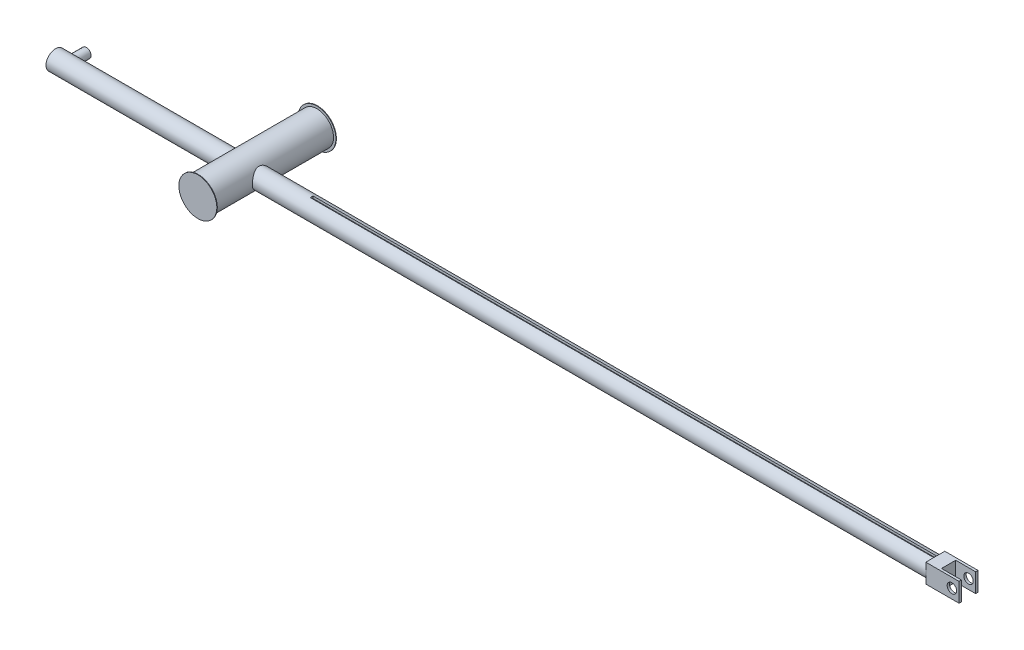
ISO-10303-21;
HEADER;
FILE_DESCRIPTION(('STEP AP214'),'2;1');
FILE_NAME('part.step','',(''),(''),'','','');
FILE_SCHEMA(('AUTOMOTIVE_DESIGN { 1 0 10303 214 1 1 1 1 }'));
ENDSEC;
DATA;
#1=APPLICATION_CONTEXT('core data for automotive mechanical design processes');
#2=APPLICATION_PROTOCOL_DEFINITION('international standard','automotive_design',2000,#1);
#3=PRODUCT_CONTEXT('',#1,'mechanical');
#4=PRODUCT('Part','Part','',(#3));
#5=PRODUCT_RELATED_PRODUCT_CATEGORY('part','',(#4));
#6=PRODUCT_DEFINITION_FORMATION('','',#4);
#7=PRODUCT_DEFINITION_CONTEXT('part definition',#1,'design');
#8=PRODUCT_DEFINITION('design','',#6,#7);
#9=PRODUCT_DEFINITION_SHAPE('','',#8);
#10=(LENGTH_UNIT() NAMED_UNIT(*) SI_UNIT(.MILLI.,.METRE.));
#11=(NAMED_UNIT(*) PLANE_ANGLE_UNIT() SI_UNIT($,.RADIAN.));
#12=(NAMED_UNIT(*) SI_UNIT($,.STERADIAN.) SOLID_ANGLE_UNIT());
#13=UNCERTAINTY_MEASURE_WITH_UNIT(LENGTH_MEASURE(1.E-05),#10,'distance_accuracy_value','');
#14=(GEOMETRIC_REPRESENTATION_CONTEXT(3) GLOBAL_UNCERTAINTY_ASSIGNED_CONTEXT((#13)) GLOBAL_UNIT_ASSIGNED_CONTEXT((#10,
#11,#12)) REPRESENTATION_CONTEXT('',''));
#15=CARTESIAN_POINT('',(0.,0.,0.));
#16=DIRECTION('',(0.,0.,1.));
#17=DIRECTION('',(1.,0.,0.));
#18=AXIS2_PLACEMENT_3D('',#15,#16,#17);
#19=CARTESIAN_POINT('',(192.4,0.,0.));
#20=DIRECTION('',(1.,0.,0.));
#21=DIRECTION('',(0.,0.,-1.));
#22=AXIS2_PLACEMENT_3D('',#19,#20,#21);
#23=PLANE('',#22);
#24=DIRECTION('',(0.,1.,0.));
#25=VECTOR('',#24,1.);
#26=CARTESIAN_POINT('',(192.4,-2.,1.5));
#27=LINE('',#26,#25);
#28=CARTESIAN_POINT('',(192.4,-2.,1.5));
#29=VERTEX_POINT('',#28);
#30=CARTESIAN_POINT('',(192.4,2.,1.5));
#31=VERTEX_POINT('',#30);
#32=EDGE_CURVE('E192',#29,#31,#27,.T.);
#33=ORIENTED_EDGE('',*,*,#32,.T.);
#34=DIRECTION('',(0.,0.,-1.));
#35=VECTOR('',#34,1.);
#36=CARTESIAN_POINT('',(192.4,2.,-2.));
#37=LINE('',#36,#35);
#38=CARTESIAN_POINT('',(192.4,2.,2.));
#39=VERTEX_POINT('',#38);
#40=EDGE_CURVE('E201',#39,#31,#37,.T.);
#41=ORIENTED_EDGE('',*,*,#40,.F.);
#42=DIRECTION('',(0.,-1.,0.));
#43=VECTOR('',#42,1.);
#44=CARTESIAN_POINT('',(192.4,2.,2.));
#45=LINE('',#44,#43);
#46=CARTESIAN_POINT('',(192.4,-2.,2.));
#47=VERTEX_POINT('',#46);
#48=EDGE_CURVE('E212',#39,#47,#45,.T.);
#49=ORIENTED_EDGE('',*,*,#48,.T.);
#50=DIRECTION('',(0.,0.,-1.));
#51=VECTOR('',#50,1.);
#52=CARTESIAN_POINT('',(192.4,-2.,-2.));
#53=LINE('',#52,#51);
#54=EDGE_CURVE('E213',#47,#29,#53,.T.);
#55=ORIENTED_EDGE('',*,*,#54,.T.);
#56=EDGE_LOOP('',(#33,#41,#49,#55));
#57=FACE_BOUND('',#56,.T.);
#58=ADVANCED_FACE('F34',(#57),#23,.T.);
#59=CARTESIAN_POINT('',(192.4,0.,0.));
#60=DIRECTION('',(-1.,0.,0.));
#61=DIRECTION('',(0.,0.,1.));
#62=AXIS2_PLACEMENT_3D('',#59,#60,#61);
#63=CYLINDRICAL_SURFACE('',#62,2.);
#64=CARTESIAN_POINT('',(43.5,0.,2.));
#65=CARTESIAN_POINT('',(43.4999955349717,-0.103121073276092,1.99999502725213));
#66=CARTESIAN_POINT('',(43.4953921880425,-0.206418292241567,1.99196945368553));
#67=CARTESIAN_POINT('',(43.4774196479239,-0.409938220573771,1.96025838229543));
#68=CARTESIAN_POINT('',(43.4640278599276,-0.510152306170781,1.93653251819956));
#69=CARTESIAN_POINT('',(43.4298464088303,-0.704136692781984,1.87470120206554));
#70=CARTESIAN_POINT('',(43.4090919539548,-0.797935169936742,1.83666413455008));
#71=CARTESIAN_POINT('',(43.361993300559,-0.977566018148799,1.74769013430304));
#72=CARTESIAN_POINT('',(43.335650659868,-1.06340059975111,1.69675679592545));
#73=CARTESIAN_POINT('',(43.2774142865461,-1.23168334606475,1.57931420254713));
#74=CARTESIAN_POINT('',(43.2452570113694,-1.31343890348908,1.51194552690007));
#75=CARTESIAN_POINT('',(43.1796447604236,-1.46516457042852,1.36544265813629));
#76=CARTESIAN_POINT('',(43.1461882973923,-1.53512065191322,1.28629466837635));
#77=CARTESIAN_POINT('',(43.0774783873558,-1.66894420512511,1.10830358077027));
#78=CARTESIAN_POINT('',(43.0424247888563,-1.73132377325173,1.00825487214971));
#79=CARTESIAN_POINT('',(42.9791301999857,-1.83811251873573,0.797049727904503));
#80=CARTESIAN_POINT('',(42.9508789226201,-1.88254890095161,0.685910428990706));
#81=CARTESIAN_POINT('',(42.9109223878371,-1.94359344806483,0.480854835647837));
#82=CARTESIAN_POINT('',(42.8969392560299,-1.96418339921187,0.3885684858251));
#83=CARTESIAN_POINT('',(42.8778133907658,-1.99210676207498,0.201150264306681));
#84=CARTESIAN_POINT('',(42.8726611811328,-1.99945438414142,0.10602155436303));
#85=CARTESIAN_POINT('',(42.871941872767,-2.00048758468052,-0.0844746853087221));
#86=CARTESIAN_POINT('',(42.876387864143,-1.99415450528781,-0.179842363786519));
#87=CARTESIAN_POINT('',(42.8942294693773,-1.96816496378147,-0.36790250518673));
#88=CARTESIAN_POINT('',(42.9076312408492,-1.94849933463808,-0.460593081672926));
#89=CARTESIAN_POINT('',(42.9415370135358,-1.8969175277205,-0.640664930319432));
#90=CARTESIAN_POINT('',(42.9620133688412,-1.86504898450024,-0.728065335499013));
#91=CARTESIAN_POINT('',(43.0078588664962,-1.79016995537344,-0.896549852677721));
#92=CARTESIAN_POINT('',(43.0332298799024,-1.74715520649774,-0.977631532555188));
#93=CARTESIAN_POINT('',(43.0909281371212,-1.64323768381765,-1.14497289536971));
#94=CARTESIAN_POINT('',(43.1237185860108,-1.5805729697491,-1.22998014172813));
#95=CARTESIAN_POINT('',(43.1897193567918,-1.44275323922578,-1.38908431950143));
#96=CARTESIAN_POINT('',(43.2229300141009,-1.36758757586109,-1.46317184839195));
#97=CARTESIAN_POINT('',(43.2905044560227,-1.19664071603843,-1.60682420141337));
#98=CARTESIAN_POINT('',(43.3245687973403,-1.09948658535069,-1.67491295111797));
#99=CARTESIAN_POINT('',(43.3858660255659,-0.893015490655637,-1.79350679145514));
#100=CARTESIAN_POINT('',(43.4131032147514,-0.783706249477125,-1.84402296365141));
#101=CARTESIAN_POINT('',(43.4559803209716,-0.563793778179159,-1.92218392422592));
#102=CARTESIAN_POINT('',(43.4722917003182,-0.453802193453638,-1.95116821061519));
#103=CARTESIAN_POINT('',(43.4942790249968,-0.229493069556969,-1.99003815887878));
#104=CARTESIAN_POINT('',(43.4999654585023,-0.115179910205488,-1.9999426552334));
#105=CARTESIAN_POINT('',(43.5000301358277,0.0995234593134482,-2.00005001113385));
#106=CARTESIAN_POINT('',(43.4956961183647,0.199920938989515,-1.99249646618427));
#107=CARTESIAN_POINT('',(43.4787417458306,0.397754958971081,-1.96259942660487));
#108=CARTESIAN_POINT('',(43.466121248704,0.495191448486274,-1.94025567842609));
#109=CARTESIAN_POINT('',(43.4339164488775,0.683570804723372,-1.88211536153292));
#110=CARTESIAN_POINT('',(43.4144048814158,0.774570013012135,-1.84645909005904));
#111=CARTESIAN_POINT('',(43.3699949687788,0.949355356164677,-1.76298426395288));
#112=CARTESIAN_POINT('',(43.345095326844,1.03313974782512,-1.71516278100544));
#113=CARTESIAN_POINT('',(43.2889746799162,1.20050997117731,-1.60310615914214));
#114=CARTESIAN_POINT('',(43.2573654662018,1.2831673708561,-1.53768066183731));
#115=CARTESIAN_POINT('',(43.1925059083551,1.43697220197862,-1.39503833887721));
#116=CARTESIAN_POINT('',(43.1592537164003,1.50810627029583,-1.31780802245906));
#117=CARTESIAN_POINT('',(43.0904217356236,1.6449272799719,-1.14359747619125));
#118=CARTESIAN_POINT('',(43.0549959728418,1.70912186715333,-1.04537520140782));
#119=CARTESIAN_POINT('',(42.9903134742197,1.81993376296719,-0.837645368584634));
#120=CARTESIAN_POINT('',(42.9610485628928,1.86657443137411,-0.728153057102555));
#121=CARTESIAN_POINT('',(42.918512334296,1.93222109228878,-0.524764735991317));
#122=CARTESIAN_POINT('',(42.9031610555495,1.95499953445202,-0.432523508968233));
#123=CARTESIAN_POINT('',(42.8811903233133,1.98724336712396,-0.244765907656752));
#124=CARTESIAN_POINT('',(42.8745609347664,1.99672390601701,-0.149253387204244));
#125=CARTESIAN_POINT('',(42.8709931203382,2.00185191685029,0.0425227698669184));
#126=CARTESIAN_POINT('',(42.8740742052857,1.99747153858607,0.138787530545769));
#127=CARTESIAN_POINT('',(42.8895014010665,1.97508383758896,0.328977150692359));
#128=CARTESIAN_POINT('',(42.9018533718013,1.95706789608754,0.422900491394058));
#129=CARTESIAN_POINT('',(42.9338380773917,1.90877044170586,0.604375633033566));
#130=CARTESIAN_POINT('',(42.9533411410288,1.87870654392501,0.692009558249193));
#131=CARTESIAN_POINT('',(42.997495532853,1.8074218972167,0.861199095743598));
#132=CARTESIAN_POINT('',(43.0221487587385,1.7661970341072,0.942752452421584));
#133=CARTESIAN_POINT('',(43.0784352308926,1.66643167949608,1.11084333294312));
#134=CARTESIAN_POINT('',(43.1105587329587,1.60620233461965,1.19621458045878));
#135=CARTESIAN_POINT('',(43.1756273473033,1.4733860443388,1.35645763372196));
#136=CARTESIAN_POINT('',(43.2085731510201,1.40078837818172,1.4313202271041));
#137=CARTESIAN_POINT('',(43.2764181020108,1.23454792336605,1.57786072312093));
#138=CARTESIAN_POINT('',(43.3110499554466,1.13941038595579,1.64798238220286));
#139=CARTESIAN_POINT('',(43.3739962322054,0.93668149876142,1.77105878863119));
#140=CARTESIAN_POINT('',(43.4023141898287,0.829097167751335,1.82402314759853));
#141=CARTESIAN_POINT('',(43.4451526868773,0.62438250119413,1.90261714413288));
#142=CARTESIAN_POINT('',(43.461231112711,0.528793868969366,1.93143235098223));
#143=CARTESIAN_POINT('',(43.4854461242423,0.33357246552143,1.97450218307986));
#144=CARTESIAN_POINT('',(43.4936056490278,0.233952251382016,1.98879887048321));
#145=CARTESIAN_POINT('',(43.4982936366316,0.111553482810445,1.99701217642184));
#146=CARTESIAN_POINT('',(43.4989325771349,0.0892655426398858,1.99813153012492));
#147=CARTESIAN_POINT('',(43.4997862645308,0.0446544907867955,1.99962601938614));
#148=CARTESIAN_POINT('',(43.5000009669239,0.02233137566042,2.00000107687301));
#149=CARTESIAN_POINT('',(43.5,0.,2.));
#150=B_SPLINE_CURVE_WITH_KNOTS('',3,(#64,#65,#66,#67,#68,#69,#70,#71,#72,#73,#74,#75,#76,#77,
#78,#79,#80,#81,#82,#83,#84,#85,#86,#87,#88,#89,#90,#91,#92,#93,#94,#95,#96,#97,#98,#99,#100,
#101,#102,#103,#104,#105,#106,#107,#108,#109,#110,#111,#112,#113,#114,#115,#116,#117,#118,#119,
#120,#121,#122,#123,#124,#125,#126,#127,#128,#129,#130,#131,#132,#133,#134,#135,#136,#137,#138,
#139,#140,#141,#142,#143,#144,#145,#146,#147,#148,#149),.UNSPECIFIED.,.T.,.F.,(4,2,2,2,2,2,2,2,
2,2,2,2,2,2,2,2,2,2,2,2,2,2,2,2,2,2,2,2,2,2,2,2,2,2,2,2,2,2,2,2,2,2,4),(0.,0.309268603260582,
0.619335457908354,0.927939130491693,1.23645688582087,1.56726264134174,1.89845895106406,
2.26564840439507,2.63227902790324,2.91779157032783,3.20299754625059,3.48859273422685,
3.77438448762791,4.05907183070886,4.343868216209,4.67430361887066,5.00502190433098,
5.37340568410989,5.7415567319231,6.08426181113764,6.4266284177419,6.72747548140297,
7.028327702629,7.32609492686909,7.62393389525625,7.95277463151786,8.28199402221957,
8.64793130772768,9.01337988790351,9.30087929443283,9.58805092761003,9.87579992974731,
10.1637309643623,10.4466801504154,10.7297337802306,11.0563737137124,11.3832982298873,
11.7509152703937,12.1183260120783,12.4204193511693,12.7216349655948,12.7886015789519,
12.85557521625),.UNSPECIFIED.);
#151=CARTESIAN_POINT('',(43.5,0.,2.));
#152=VERTEX_POINT('',#151);
#153=EDGE_CURVE('E258',#152,#152,#150,.T.);
#154=ORIENTED_EDGE('',*,*,#153,.T.);
#155=EDGE_LOOP('',(#154));
#156=FACE_BOUND('',#155,.T.);
#157=DIRECTION('',(-1.,0.,0.));
#158=VECTOR('',#157,1.);
#159=CARTESIAN_POINT('',(192.4,1.97737199332852,0.3));
#160=LINE('',#159,#158);
#161=CARTESIAN_POINT('',(185.4,1.97737199332852,0.3));
#162=VERTEX_POINT('',#161);
#163=CARTESIAN_POINT('',(54.,1.97737199332852,0.3));
#164=VERTEX_POINT('',#163);
#165=EDGE_CURVE('E158',#162,#164,#160,.T.);
#166=ORIENTED_EDGE('',*,*,#165,.T.);
#167=CARTESIAN_POINT('',(54.,0.,0.));
#168=DIRECTION('',(-1.,0.,0.));
#169=DIRECTION('',(0.,0.,1.));
#170=AXIS2_PLACEMENT_3D('',#167,#168,#169);
#171=CIRCLE('',#170,2.);
#172=CARTESIAN_POINT('',(54.,1.97737199332851,-0.300000000000001));
#173=VERTEX_POINT('',#172);
#174=EDGE_CURVE('E11',#164,#173,#171,.T.);
#175=ORIENTED_EDGE('',*,*,#174,.T.);
#176=DIRECTION('',(-1.,0.,0.));
#177=VECTOR('',#176,1.);
#178=CARTESIAN_POINT('',(192.4,1.97737199332851,-0.300000000000035));
#179=LINE('',#178,#177);
#180=CARTESIAN_POINT('',(185.4,1.97737199332851,-0.300000000000034));
#181=VERTEX_POINT('',#180);
#182=EDGE_CURVE('E163',#173,#181,#179,.F.);
#183=ORIENTED_EDGE('',*,*,#182,.T.);
#184=CARTESIAN_POINT('',(185.4,0.,0.));
#185=DIRECTION('',(1.,0.,0.));
#186=DIRECTION('',(0.,0.,-1.));
#187=AXIS2_PLACEMENT_3D('',#184,#185,#186);
#188=CIRCLE('',#187,2.);
#189=CARTESIAN_POINT('',(185.4,0.,-2.));
#190=VERTEX_POINT('',#189);
#191=EDGE_CURVE('E340',#190,#181,#188,.T.);
#192=ORIENTED_EDGE('',*,*,#191,.F.);
#193=CARTESIAN_POINT('',(185.4,-2.,0.));
#194=VERTEX_POINT('',#193);
#195=EDGE_CURVE('E262',#194,#190,#188,.T.);
#196=ORIENTED_EDGE('',*,*,#195,.F.);
#197=CARTESIAN_POINT('',(185.4,0.,2.));
#198=VERTEX_POINT('',#197);
#199=EDGE_CURVE('E347',#198,#194,#188,.T.);
#200=ORIENTED_EDGE('',*,*,#199,.F.);
#201=EDGE_CURVE('E43',#162,#198,#188,.T.);
#202=ORIENTED_EDGE('',*,*,#201,.F.);
#203=EDGE_LOOP('',(#166,#175,#183,#192,#196,#200,#202));
#204=FACE_BOUND('',#203,.T.);
#205=ADVANCED_FACE('F295',(#156,#204),#63,.T.);
#206=CARTESIAN_POINT('',(40.,0.,-15.1));
#207=DIRECTION('',(0.,0.,1.));
#208=DIRECTION('',(1.,0.,0.));
#209=AXIS2_PLACEMENT_3D('',#206,#207,#208);
#210=CYLINDRICAL_SURFACE('',#209,3.5);
#211=ORIENTED_EDGE('',*,*,#153,.F.);
#212=EDGE_LOOP('',(#211));
#213=FACE_BOUND('',#212,.T.);
#214=CARTESIAN_POINT('',(36.5,0.,2.));
#215=CARTESIAN_POINT('',(36.5000044650284,0.103121073276098,1.99999502725213));
#216=CARTESIAN_POINT('',(36.5046078119575,0.206418292241578,1.99196945368553));
#217=CARTESIAN_POINT('',(36.522580352076,0.409938220573787,1.96025838229543));
#218=CARTESIAN_POINT('',(36.5359721400724,0.510152306170795,1.93653251819956));
#219=CARTESIAN_POINT('',(36.5701535911697,0.704136692781999,1.87470120206554));
#220=CARTESIAN_POINT('',(36.5909080460452,0.797935169936758,1.83666413455008));
#221=CARTESIAN_POINT('',(36.638006699441,0.977566018148819,1.74769013430303));
#222=CARTESIAN_POINT('',(36.664349340132,1.06340059975114,1.69675679592544));
#223=CARTESIAN_POINT('',(36.7225857134539,1.23168334606478,1.57931420254711));
#224=CARTESIAN_POINT('',(36.7547429886306,1.31343890348911,1.51194552690005));
#225=CARTESIAN_POINT('',(36.8203552395764,1.46516457042855,1.36544265813626));
#226=CARTESIAN_POINT('',(36.8538117026077,1.53512065191324,1.28629466837632));
#227=CARTESIAN_POINT('',(36.9225216126442,1.66894420512513,1.10830358077024));
#228=CARTESIAN_POINT('',(36.9575752111437,1.73132377325175,1.00825487214967));
#229=CARTESIAN_POINT('',(37.0208698000143,1.83811251873575,0.797049727904456));
#230=CARTESIAN_POINT('',(37.0491210773799,1.88254890095163,0.685910428990657));
#231=CARTESIAN_POINT('',(37.0890776121629,1.94359344806484,0.480854835647787));
#232=CARTESIAN_POINT('',(37.1030607439701,1.96418339921188,0.388568485825054));
#233=CARTESIAN_POINT('',(37.1221866092342,1.99210676207498,0.201150264306641));
#234=CARTESIAN_POINT('',(37.1273388188672,1.99945438414142,0.106021554362994));
#235=CARTESIAN_POINT('',(37.128058127233,2.00048758468052,-0.0844746853087508));
#236=CARTESIAN_POINT('',(37.123612135857,1.99415450528781,-0.179842363786543));
#237=CARTESIAN_POINT('',(37.1057705306227,1.96816496378146,-0.367902505186745));
#238=CARTESIAN_POINT('',(37.0923687591508,1.94849933463808,-0.460593081672937));
#239=CARTESIAN_POINT('',(37.0584629864642,1.8969175277205,-0.640664930319436));
#240=CARTESIAN_POINT('',(37.0379866311588,1.86504898450024,-0.728065335499013));
#241=CARTESIAN_POINT('',(36.9921411335038,1.79016995537345,-0.896549852677715));
#242=CARTESIAN_POINT('',(36.9667701200976,1.74715520649775,-0.97763153255518));
#243=CARTESIAN_POINT('',(36.9090718628788,1.64323768381766,-1.1449728953697));
#244=CARTESIAN_POINT('',(36.8762814139892,1.58057296974911,-1.22998014172812));
#245=CARTESIAN_POINT('',(36.8102806432082,1.44275323922579,-1.38908431950141));
#246=CARTESIAN_POINT('',(36.7770699858991,1.36758757586111,-1.46317184839193));
#247=CARTESIAN_POINT('',(36.7094955439773,1.19664071603845,-1.60682420141335));
#248=CARTESIAN_POINT('',(36.6754312026597,1.09948658535071,-1.67491295111796));
#249=CARTESIAN_POINT('',(36.6141339744341,0.893015490655655,-1.79350679145513));
#250=CARTESIAN_POINT('',(36.5868967852486,0.783706249477144,-1.8440229636514));
#251=CARTESIAN_POINT('',(36.5440196790284,0.563793778179177,-1.92218392422592));
#252=CARTESIAN_POINT('',(36.5277082996818,0.453802193453655,-1.95116821061519));
#253=CARTESIAN_POINT('',(36.5057209750032,0.229493069556984,-1.99003815887878));
#254=CARTESIAN_POINT('',(36.5000345414977,0.1151799102055,-1.9999426552334));
#255=CARTESIAN_POINT('',(36.4999698641723,-0.0995234593134409,-2.00005001113385));
#256=CARTESIAN_POINT('',(36.5043038816353,-0.199920938989511,-1.99249646618427));
#257=CARTESIAN_POINT('',(36.5212582541694,-0.397754958971082,-1.96259942660487));
#258=CARTESIAN_POINT('',(36.533878751296,-0.495191448486278,-1.94025567842609));
#259=CARTESIAN_POINT('',(36.5660835511226,-0.683570804723379,-1.88211536153292));
#260=CARTESIAN_POINT('',(36.5855951185842,-0.774570013012145,-1.84645909005903));
#261=CARTESIAN_POINT('',(36.6300050312212,-0.94935535616469,-1.76298426395287));
#262=CARTESIAN_POINT('',(36.654904673156,-1.03313974782513,-1.71516278100543));
#263=CARTESIAN_POINT('',(36.7110253200838,-1.20050997117733,-1.60310615914212));
#264=CARTESIAN_POINT('',(36.7426345337982,-1.28316737085612,-1.5376806618373));
#265=CARTESIAN_POINT('',(36.8074940916449,-1.43697220197864,-1.39503833887719));
#266=CARTESIAN_POINT('',(36.8407462835997,-1.50810627029585,-1.31780802245903));
#267=CARTESIAN_POINT('',(36.9095782643764,-1.64492727997192,-1.14359747619122));
#268=CARTESIAN_POINT('',(36.9450040271582,-1.70912186715335,-1.04537520140779));
#269=CARTESIAN_POINT('',(37.0096865257803,-1.81993376296721,-0.837645368584599));
#270=CARTESIAN_POINT('',(37.0389514371072,-1.86657443137412,-0.728153057102519));
#271=CARTESIAN_POINT('',(37.081487665704,-1.93222109228879,-0.52476473599128));
#272=CARTESIAN_POINT('',(37.0968389444505,-1.95499953445203,-0.432523508968198));
#273=CARTESIAN_POINT('',(37.1188096766867,-1.98724336712396,-0.244765907656723));
#274=CARTESIAN_POINT('',(37.1254390652336,-1.99672390601701,-0.14925338720422));
#275=CARTESIAN_POINT('',(37.1290068796618,-2.00185191685028,0.0425227698669336));
#276=CARTESIAN_POINT('',(37.1259257947143,-1.99747153858607,0.13878753054578));
#277=CARTESIAN_POINT('',(37.1104985989335,-1.97508383758896,0.328977150692361));
#278=CARTESIAN_POINT('',(37.0981466281987,-1.95706789608754,0.422900491394057));
#279=CARTESIAN_POINT('',(37.0661619226083,-1.90877044170586,0.604375633033557));
#280=CARTESIAN_POINT('',(37.0466588589712,-1.87870654392502,0.69200955824918));
#281=CARTESIAN_POINT('',(37.002504467147,-1.80742189721671,0.861199095743579));
#282=CARTESIAN_POINT('',(36.9778512412615,-1.76619703410721,0.942752452421563));
#283=CARTESIAN_POINT('',(36.9215647691074,-1.66643167949609,1.1108433329431));
#284=CARTESIAN_POINT('',(36.8894412670413,-1.60620233461967,1.19621458045875));
#285=CARTESIAN_POINT('',(36.8243726526967,-1.47338604433883,1.35645763372193));
#286=CARTESIAN_POINT('',(36.7914268489799,-1.40078837818175,1.43132022710407));
#287=CARTESIAN_POINT('',(36.7235818979893,-1.23454792336608,1.5778607231209));
#288=CARTESIAN_POINT('',(36.6889500445534,-1.13941038595583,1.64798238220283));
#289=CARTESIAN_POINT('',(36.6260037677946,-0.936681498761457,1.77105878863117));
#290=CARTESIAN_POINT('',(36.5976858101713,-0.829097167751373,1.82402314759851));
#291=CARTESIAN_POINT('',(36.5548473131227,-0.624382501194166,1.90261714413287));
#292=CARTESIAN_POINT('',(36.538768887289,-0.5287938689694,1.93143235098222));
#293=CARTESIAN_POINT('',(36.5145538757578,-0.33357246552146,1.97450218307986));
#294=CARTESIAN_POINT('',(36.5063943509723,-0.233952251382045,1.9887988704832));
#295=CARTESIAN_POINT('',(36.5017063633684,-0.111553482810469,1.99701217642184));
#296=CARTESIAN_POINT('',(36.5010674228651,-0.0892655426399053,1.99813153012492));
#297=CARTESIAN_POINT('',(36.5002137354692,-0.0446544907868056,1.99962601938614));
#298=CARTESIAN_POINT('',(36.4999990330762,-0.0223313756604251,2.00000107687301));
#299=CARTESIAN_POINT('',(36.5,0.,2.));
#300=B_SPLINE_CURVE_WITH_KNOTS('',3,(#214,#215,#216,#217,#218,#219,#220,#221,#222,#223,#224,
#225,#226,#227,#228,#229,#230,#231,#232,#233,#234,#235,#236,#237,#238,#239,#240,#241,#242,#243,
#244,#245,#246,#247,#248,#249,#250,#251,#252,#253,#254,#255,#256,#257,#258,#259,#260,#261,#262,
#263,#264,#265,#266,#267,#268,#269,#270,#271,#272,#273,#274,#275,#276,#277,#278,#279,#280,#281,
#282,#283,#284,#285,#286,#287,#288,#289,#290,#291,#292,#293,#294,#295,#296,#297,#298,#299),
.UNSPECIFIED.,.T.,.F.,(4,2,2,2,2,2,2,2,2,2,2,2,2,2,2,2,2,2,2,2,2,2,2,2,2,2,2,2,2,2,2,2,2,2,2,2,
2,2,2,2,2,2,4),(0.,0.309268603260594,0.619335457908367,0.927939130491709,1.2364568858209,
1.56726264134178,1.8984589510641,2.26564840439512,2.63227902790329,2.91779157032787,
3.20299754625062,3.48859273422687,3.77438448762791,4.05907183070885,4.34386821620898,
4.67430361887064,5.00502190433095,5.37340568410986,5.74155673192308,6.08426181113762,
6.42662841774189,6.72747548140296,7.028327702629,7.3260949268691,7.62393389525627,
7.95277463151788,8.2819940222196,8.64793130772771,9.01337988790355,9.30087929443286,
9.58805092761005,9.87579992974731,10.1637309643622,10.4466801504154,10.7297337802306,
11.0563737137124,11.3832982298872,11.7509152703936,12.1183260120782,12.4204193511693,
12.7216349655948,12.7886015789519,12.85557521625),.UNSPECIFIED.);
#301=CARTESIAN_POINT('',(36.5,0.,2.));
#302=VERTEX_POINT('',#301);
#303=EDGE_CURVE('E269',#302,#302,#300,.T.);
#304=ORIENTED_EDGE('',*,*,#303,.F.);
#305=EDGE_LOOP('',(#304));
#306=FACE_BOUND('',#305,.T.);
#307=CARTESIAN_POINT('',(40.,0.,-15.1));
#308=DIRECTION('',(0.,0.,1.));
#309=DIRECTION('',(1.,0.,0.));
#310=AXIS2_PLACEMENT_3D('',#307,#308,#309);
#311=CIRCLE('',#310,3.5);
#312=CARTESIAN_POINT('',(43.5,0.,-15.1));
#313=VERTEX_POINT('',#312);
#314=EDGE_CURVE('E242',#313,#313,#311,.T.);
#315=ORIENTED_EDGE('',*,*,#314,.T.);
#316=EDGE_LOOP('',(#315));
#317=FACE_BOUND('',#316,.T.);
#318=CARTESIAN_POINT('',(40.,0.,9.9));
#319=DIRECTION('',(0.,0.,1.));
#320=DIRECTION('',(1.,0.,0.));
#321=AXIS2_PLACEMENT_3D('',#318,#319,#320);
#322=CIRCLE('',#321,3.5);
#323=CARTESIAN_POINT('',(43.5,0.,9.9));
#324=VERTEX_POINT('',#323);
#325=EDGE_CURVE('E248',#324,#324,#322,.F.);
#326=ORIENTED_EDGE('',*,*,#325,.T.);
#327=EDGE_LOOP('',(#326));
#328=FACE_BOUND('',#327,.T.);
#329=ADVANCED_FACE('F293',(#213,#306,#317,#328),#210,.T.);
#330=ORIENTED_EDGE('',*,*,#303,.T.);
#331=EDGE_LOOP('',(#330));
#332=FACE_BOUND('',#331,.T.);
#333=CARTESIAN_POINT('',(3.,0.,-2.));
#334=CARTESIAN_POINT('',(2.9999966976805,0.0525719629529861,-1.99999713404151));
#335=CARTESIAN_POINT('',(2.99582992687833,0.105206599698032,-1.99790491019518));
#336=CARTESIAN_POINT('',(2.97934711965908,0.208920235268424,-1.98974156037396));
#337=CARTESIAN_POINT('',(2.96701560700235,0.259996086713502,-1.98366287828984));
#338=CARTESIAN_POINT('',(2.93480619138321,0.358933544880572,-1.96816279403312));
#339=CARTESIAN_POINT('',(2.91495761575199,0.406806802939177,-1.9587543917752));
#340=CARTESIAN_POINT('',(2.86842937863506,0.498472616806562,-1.93745776515779));
#341=CARTESIAN_POINT('',(2.84175025575115,0.542265493990046,-1.9255697363353));
#342=CARTESIAN_POINT('',(2.7804827505147,0.627507817761915,-1.89956258258057));
#343=CARTESIAN_POINT('',(2.74551352076036,0.668655211122108,-1.88535199127536));
#344=CARTESIAN_POINT('',(2.66947852075297,0.744779444866974,-1.85659970246745));
#345=CARTESIAN_POINT('',(2.62840814822756,0.779751583106763,-1.84205776209035));
#346=CARTESIAN_POINT('',(2.53751665047662,0.845252000450276,-1.81298951197347));
#347=CARTESIAN_POINT('',(2.48726390165409,0.875225335551635,-1.79855186970132));
#348=CARTESIAN_POINT('',(2.38163266401379,0.926168226890694,-1.77285978772321));
#349=CARTESIAN_POINT('',(2.32625787127725,0.947144214966333,-1.7616030760699));
#350=CARTESIAN_POINT('',(2.21533489457808,0.978132442188588,-1.74457867037808));
#351=CARTESIAN_POINT('',(2.15999554793261,0.988725857080441,-1.73852271583714));
#352=CARTESIAN_POINT('',(2.04802116222052,1.00042699330885,-1.73181889948528));
#353=CARTESIAN_POINT('',(1.99138745912884,1.00154408837307,-1.73116569343288));
#354=CARTESIAN_POINT('',(1.88571397568463,0.994687287172294,-1.73510930257248));
#355=CARTESIAN_POINT('',(1.83657596877695,0.987784559536821,-1.73908763662014));
#356=CARTESIAN_POINT('',(1.74027809062695,0.966939849056931,-1.7507622873385));
#357=CARTESIAN_POINT('',(1.69311885469468,0.95299562389765,-1.75845978831776));
#358=CARTESIAN_POINT('',(1.60077086743434,0.918209780386002,-1.77687476412741));
#359=CARTESIAN_POINT('',(1.55565360121421,0.897215067115993,-1.78765840663999));
#360=CARTESIAN_POINT('',(1.46936570740999,0.849041687668001,-1.81103404281404));
#361=CARTESIAN_POINT('',(1.42819686439991,0.821860243812466,-1.82362684780191));
#362=CARTESIAN_POINT('',(1.34547874725677,0.758066054912788,-1.85113157903286));
#363=CARTESIAN_POINT('',(1.30454312642384,0.720694458369282,-1.86613510236746));
#364=CARTESIAN_POINT('',(1.2292645814091,0.639555578741374,-1.89547623300407));
#365=CARTESIAN_POINT('',(1.19492480796612,0.595785256574287,-1.90981351958801));
#366=CARTESIAN_POINT('',(1.13231433897027,0.500516505831851,-1.93701987282964));
#367=CARTESIAN_POINT('',(1.10439952755426,0.448753591599412,-1.94978984162007));
#368=CARTESIAN_POINT('',(1.05790297095699,0.340466215488802,-1.97157881121242));
#369=CARTESIAN_POINT('',(1.03931381498483,0.283945576265282,-1.98060078943552));
#370=CARTESIAN_POINT('',(1.01352459628333,0.172766491660708,-1.99324333741436));
#371=CARTESIAN_POINT('',(1.00550876425322,0.11834153054833,-1.99724938301312));
#372=CARTESIAN_POINT('',(0.99853526886551,0.00877959994935837,-2.00073013459102));
#373=CARTESIAN_POINT('',(0.99957331436052,-0.046357019869897,-2.00020698721312));
#374=CARTESIAN_POINT('',(1.01020668841875,-0.15123297198599,-1.99491192253441));
#375=CARTESIAN_POINT('',(1.01913253273003,-0.201059408049952,-1.9904724568819));
#376=CARTESIAN_POINT('',(1.04423807189508,-0.298406892301915,-1.97822171314819));
#377=CARTESIAN_POINT('',(1.06041856645336,-0.345927685690996,-1.97041006334333));
#378=CARTESIAN_POINT('',(1.09999846643317,-0.438888608449665,-1.95184251413669));
#379=CARTESIAN_POINT('',(1.12359105011681,-0.484230397006154,-1.94100881769939));
#380=CARTESIAN_POINT('',(1.17710753564604,-0.570461361698922,-1.91743974317109));
#381=CARTESIAN_POINT('',(1.20703413459343,-0.611348629775283,-1.90470355565785));
#382=CARTESIAN_POINT('',(1.27576042533288,-0.691767689290655,-1.87708221337464));
#383=CARTESIAN_POINT('',(1.31514286845357,-0.73077207782464,-1.86210884848441));
#384=CARTESIAN_POINT('',(1.39992515126931,-0.801856321113241,-1.83262391603874));
#385=CARTESIAN_POINT('',(1.44532911881638,-0.833931385690842,-1.81811267381526));
#386=CARTESIAN_POINT('',(1.54364365420031,-0.891707914497696,-1.79051192226068));
#387=CARTESIAN_POINT('',(1.5968112662086,-0.917025495878638,-1.77752529663472));
#388=CARTESIAN_POINT('',(1.70751006769252,-0.958082826013803,-1.75574072368126));
#389=CARTESIAN_POINT('',(1.76503552650119,-0.97383491588757,-1.74693738240618));
#390=CARTESIAN_POINT('',(1.87691022286144,-0.993861687449679,-1.73561501008667));
#391=CARTESIAN_POINT('',(1.93103425342903,-0.999092996400864,-1.73257383460491));
#392=CARTESIAN_POINT('',(2.03944706717072,-1.00068915438079,-1.73165354646175));
#393=CARTESIAN_POINT('',(2.09373576873943,-0.997057846624399,-1.73377219627553));
#394=CARTESIAN_POINT('',(2.19548350153201,-0.981926125592265,-1.74237862050025));
#395=CARTESIAN_POINT('',(2.24310047014439,-0.971208314342802,-1.74843094482393));
#396=CARTESIAN_POINT('',(2.3358081194247,-0.943175358224648,-1.76371016187917));
#397=CARTESIAN_POINT('',(2.38089798209196,-0.925858091159813,-1.77293807569675));
#398=CARTESIAN_POINT('',(2.4706248509866,-0.883815745300687,-1.79428530364528));
#399=CARTESIAN_POINT('',(2.5150279018297,-0.858671137816462,-1.8065572239619));
#400=CARTESIAN_POINT('',(2.59927453618058,-0.802150971636638,-1.8323533163459));
#401=CARTESIAN_POINT('',(2.63911573051849,-0.770772171238652,-1.84587813794522));
#402=CARTESIAN_POINT('',(2.71814198235761,-0.698203326664644,-1.87462323159313));
#403=CARTESIAN_POINT('',(2.75665910236192,-0.656284423010173,-1.88984983311468));
#404=CARTESIAN_POINT('',(2.82626298342363,-0.566154806220281,-1.91877752255088));
#405=CARTESIAN_POINT('',(2.85734573942629,-0.517940723256785,-1.9324777860804));
#406=CARTESIAN_POINT('',(2.9112363627622,-0.415931596819946,-1.95698009585103));
#407=CARTESIAN_POINT('',(2.93398416941144,-0.362099503934613,-1.96776096562909));
#408=CARTESIAN_POINT('',(2.96980816791895,-0.250742101294189,-1.98501341363466));
#409=CARTESIAN_POINT('',(2.98291184682958,-0.193227799623164,-1.99149723372932));
#410=CARTESIAN_POINT('',(2.99389741107585,-0.112601946483382,-1.99695461909663));
#411=CARTESIAN_POINT('',(2.99618264086362,-0.0901618794394968,-1.99809365339202));
#412=CARTESIAN_POINT('',(2.99923466551681,-0.0451517318071566,-1.99961696977865));
#413=CARTESIAN_POINT('',(3.0000014184712,-0.0225816476473809,-2.00000123103763));
#414=CARTESIAN_POINT('',(3.,0.,-2.));
#415=B_SPLINE_CURVE_WITH_KNOTS('',3,(#333,#334,#335,#336,#337,#338,#339,#340,#341,#342,#343,
#344,#345,#346,#347,#348,#349,#350,#351,#352,#353,#354,#355,#356,#357,#358,#359,#360,#361,#362,
#363,#364,#365,#366,#367,#368,#369,#370,#371,#372,#373,#374,#375,#376,#377,#378,#379,#380,#381,
#382,#383,#384,#385,#386,#387,#388,#389,#390,#391,#392,#393,#394,#395,#396,#397,#398,#399,#400,
#401,#402,#403,#404,#405,#406,#407,#408,#409,#410,#411,#412,#413,#414),.UNSPECIFIED.,.T.,.F.,(4,
2,2,2,2,2,2,2,2,2,2,2,2,2,2,2,2,2,2,2,2,2,2,2,2,2,2,2,2,2,2,2,2,2,2,2,2,2,2,2,4),(0.,
0.157624257420291,0.315548149709195,0.472862155492295,0.630163760581563,0.796981758718083,
0.963926237654029,1.14381726430752,1.32357947898281,1.4925801214023,1.66141357329021,
1.81005712409321,1.95874803925679,2.11090240168488,2.26312521260222,2.43464941333878,
2.60625534598686,2.7858302221444,2.96526216912279,3.12983290471345,3.29432564511476,
3.44606906506122,3.59782921630932,3.75392856027899,3.9100945074834,4.08159610644419,
4.25321588615432,4.43314682159674,4.61284511940777,4.77529307498373,4.93767059860004,
5.08457930244182,5.23153528783677,5.38836456775614,5.54527561138957,5.72125242752498,
5.89732383376573,6.07464013662925,6.2514490862493,6.31915280137698,6.38685838514847),.UNSPECIFIED.);
#416=CARTESIAN_POINT('',(3.,0.,-2.));
#417=VERTEX_POINT('',#416);
#418=EDGE_CURVE('E257',#417,#417,#415,.T.);
#419=ORIENTED_EDGE('',*,*,#418,.T.);
#420=EDGE_LOOP('',(#419));
#421=FACE_BOUND('',#420,.T.);
#422=CARTESIAN_POINT('',(0.,0.,0.));
#423=DIRECTION('',(1.,0.,0.));
#424=DIRECTION('',(0.,0.,-1.));
#425=AXIS2_PLACEMENT_3D('',#422,#423,#424);
#426=CIRCLE('',#425,2.);
#427=CARTESIAN_POINT('',(0.,0.,-2.));
#428=VERTEX_POINT('',#427);
#429=EDGE_CURVE('E259',#428,#428,#426,.T.);
#430=ORIENTED_EDGE('',*,*,#429,.T.);
#431=EDGE_LOOP('',(#430));
#432=FACE_BOUND('',#431,.T.);
#433=ADVANCED_FACE('F36',(#332,#421,#432),#63,.T.);
#434=CARTESIAN_POINT('',(0.,0.,0.));
#435=DIRECTION('',(1.,0.,0.));
#436=DIRECTION('',(0.,0.,-1.));
#437=AXIS2_PLACEMENT_3D('',#434,#435,#436);
#438=PLANE('',#437);
#439=ORIENTED_EDGE('',*,*,#429,.F.);
#440=EDGE_LOOP('',(#439));
#441=FACE_BOUND('',#440,.T.);
#442=ADVANCED_FACE('F281',(#441),#438,.F.);
#443=CARTESIAN_POINT('',(2.,0.,-4.5));
#444=DIRECTION('',(0.,0.,1.));
#445=DIRECTION('',(1.,0.,0.));
#446=AXIS2_PLACEMENT_3D('',#443,#444,#445);
#447=CYLINDRICAL_SURFACE('',#446,1.);
#448=CARTESIAN_POINT('',(2.,0.,-4.5));
#449=DIRECTION('',(0.,0.,1.));
#450=DIRECTION('',(1.,0.,0.));
#451=AXIS2_PLACEMENT_3D('',#448,#449,#450);
#452=CIRCLE('',#451,1.);
#453=CARTESIAN_POINT('',(3.,0.,-4.5));
#454=VERTEX_POINT('',#453);
#455=EDGE_CURVE('E254',#454,#454,#452,.T.);
#456=ORIENTED_EDGE('',*,*,#455,.T.);
#457=EDGE_LOOP('',(#456));
#458=FACE_BOUND('',#457,.T.);
#459=ORIENTED_EDGE('',*,*,#418,.F.);
#460=EDGE_LOOP('',(#459));
#461=FACE_BOUND('',#460,.T.);
#462=ADVANCED_FACE('F275',(#458,#461),#447,.T.);
#463=CARTESIAN_POINT('',(2.,0.,-4.5));
#464=DIRECTION('',(0.,0.,1.));
#465=DIRECTION('',(1.,0.,0.));
#466=AXIS2_PLACEMENT_3D('',#463,#464,#465);
#467=PLANE('',#466);
#468=ORIENTED_EDGE('',*,*,#455,.F.);
#469=EDGE_LOOP('',(#468));
#470=FACE_BOUND('',#469,.T.);
#471=ADVANCED_FACE('F280',(#470),#467,.F.);
#472=CARTESIAN_POINT('',(40.,0.,9.9));
#473=DIRECTION('',(0.,0.,1.));
#474=DIRECTION('',(1.,0.,0.));
#475=AXIS2_PLACEMENT_3D('',#472,#473,#474);
#476=CYLINDRICAL_SURFACE('',#475,4.);
#477=CARTESIAN_POINT('',(40.,0.,9.9));
#478=DIRECTION('',(0.,0.,1.));
#479=DIRECTION('',(1.,0.,0.));
#480=AXIS2_PLACEMENT_3D('',#477,#478,#479);
#481=CIRCLE('',#480,4.);
#482=CARTESIAN_POINT('',(44.,0.,9.9));
#483=VERTEX_POINT('',#482);
#484=EDGE_CURVE('E245',#483,#483,#481,.T.);
#485=ORIENTED_EDGE('',*,*,#484,.T.);
#486=EDGE_LOOP('',(#485));
#487=FACE_BOUND('',#486,.T.);
#488=CARTESIAN_POINT('',(40.,0.,10.));
#489=DIRECTION('',(0.,0.,1.));
#490=DIRECTION('',(1.,0.,0.));
#491=AXIS2_PLACEMENT_3D('',#488,#489,#490);
#492=CIRCLE('',#491,4.);
#493=CARTESIAN_POINT('',(44.,0.,10.));
#494=VERTEX_POINT('',#493);
#495=EDGE_CURVE('E249',#494,#494,#492,.T.);
#496=ORIENTED_EDGE('',*,*,#495,.F.);
#497=EDGE_LOOP('',(#496));
#498=FACE_BOUND('',#497,.T.);
#499=ADVANCED_FACE('F404',(#487,#498),#476,.T.);
#500=CARTESIAN_POINT('',(40.,0.,9.9));
#501=DIRECTION('',(0.,0.,1.));
#502=DIRECTION('',(1.,0.,0.));
#503=AXIS2_PLACEMENT_3D('',#500,#501,#502);
#504=PLANE('',#503);
#505=ORIENTED_EDGE('',*,*,#325,.F.);
#506=EDGE_LOOP('',(#505));
#507=FACE_BOUND('',#506,.T.);
#508=ORIENTED_EDGE('',*,*,#484,.F.);
#509=EDGE_LOOP('',(#508));
#510=FACE_BOUND('',#509,.T.);
#511=ADVANCED_FACE('F401',(#507,#510),#504,.F.);
#512=CARTESIAN_POINT('',(40.,0.,10.));
#513=DIRECTION('',(0.,0.,1.));
#514=DIRECTION('',(1.,0.,0.));
#515=AXIS2_PLACEMENT_3D('',#512,#513,#514);
#516=PLANE('',#515);
#517=ORIENTED_EDGE('',*,*,#495,.T.);
#518=EDGE_LOOP('',(#517));
#519=FACE_BOUND('',#518,.T.);
#520=ADVANCED_FACE('F399',(#519),#516,.T.);
#521=CARTESIAN_POINT('',(40.,0.,-15.2));
#522=DIRECTION('',(0.,0.,1.));
#523=DIRECTION('',(1.,0.,0.));
#524=AXIS2_PLACEMENT_3D('',#521,#522,#523);
#525=CYLINDRICAL_SURFACE('',#524,4.);
#526=CARTESIAN_POINT('',(40.,0.,-15.2));
#527=DIRECTION('',(0.,0.,-1.));
#528=DIRECTION('',(-1.,0.,0.));
#529=AXIS2_PLACEMENT_3D('',#526,#527,#528);
#530=CIRCLE('',#529,4.);
#531=CARTESIAN_POINT('',(36.,0.,-15.2));
#532=VERTEX_POINT('',#531);
#533=EDGE_CURVE('E239',#532,#532,#530,.T.);
#534=ORIENTED_EDGE('',*,*,#533,.F.);
#535=EDGE_LOOP('',(#534));
#536=FACE_BOUND('',#535,.T.);
#537=CARTESIAN_POINT('',(40.,0.,-15.1));
#538=DIRECTION('',(0.,0.,-1.));
#539=DIRECTION('',(-1.,0.,0.));
#540=AXIS2_PLACEMENT_3D('',#537,#538,#539);
#541=CIRCLE('',#540,4.);
#542=CARTESIAN_POINT('',(36.,0.,-15.1));
#543=VERTEX_POINT('',#542);
#544=EDGE_CURVE('E238',#543,#543,#541,.T.);
#545=ORIENTED_EDGE('',*,*,#544,.T.);
#546=EDGE_LOOP('',(#545));
#547=FACE_BOUND('',#546,.T.);
#548=ADVANCED_FACE('F392',(#536,#547),#525,.T.);
#549=CARTESIAN_POINT('',(40.,0.,-15.2));
#550=DIRECTION('',(0.,0.,-1.));
#551=DIRECTION('',(-1.,0.,0.));
#552=AXIS2_PLACEMENT_3D('',#549,#550,#551);
#553=PLANE('',#552);
#554=ORIENTED_EDGE('',*,*,#533,.T.);
#555=EDGE_LOOP('',(#554));
#556=FACE_BOUND('',#555,.T.);
#557=ADVANCED_FACE('F389',(#556),#553,.T.);
#558=CARTESIAN_POINT('',(40.,0.,-15.1));
#559=DIRECTION('',(0.,0.,-1.));
#560=DIRECTION('',(-1.,0.,0.));
#561=AXIS2_PLACEMENT_3D('',#558,#559,#560);
#562=PLANE('',#561);
#563=ORIENTED_EDGE('',*,*,#314,.F.);
#564=EDGE_LOOP('',(#563));
#565=FACE_BOUND('',#564,.T.);
#566=ORIENTED_EDGE('',*,*,#544,.F.);
#567=EDGE_LOOP('',(#566));
#568=FACE_BOUND('',#567,.T.);
#569=ADVANCED_FACE('F387',(#565,#568),#562,.F.);
#570=CARTESIAN_POINT('',(192.4,2.,-2.));
#571=DIRECTION('',(0.,0.,1.));
#572=DIRECTION('',(1.,0.,0.));
#573=AXIS2_PLACEMENT_3D('',#570,#571,#572);
#574=PLANE('',#573);
#575=CARTESIAN_POINT('',(190.9,0.,-2.));
#576=DIRECTION('',(0.,0.,1.));
#577=DIRECTION('',(1.,0.,0.));
#578=AXIS2_PLACEMENT_3D('',#575,#576,#577);
#579=CIRCLE('',#578,0.999999999999998);
#580=CARTESIAN_POINT('',(191.9,0.,-2.));
#581=VERTEX_POINT('',#580);
#582=EDGE_CURVE('E167',#581,#581,#579,.T.);
#583=ORIENTED_EDGE('',*,*,#582,.T.);
#584=EDGE_LOOP('',(#583));
#585=FACE_BOUND('',#584,.T.);
#586=DIRECTION('',(0.,-1.,0.));
#587=VECTOR('',#586,1.);
#588=CARTESIAN_POINT('',(192.4,2.,-2.));
#589=LINE('',#588,#587);
#590=CARTESIAN_POINT('',(192.4,2.,-2.));
#591=VERTEX_POINT('',#590);
#592=CARTESIAN_POINT('',(192.4,-2.,-2.));
#593=VERTEX_POINT('',#592);
#594=EDGE_CURVE('E235',#591,#593,#589,.T.);
#595=ORIENTED_EDGE('',*,*,#594,.T.);
#596=DIRECTION('',(-1.,0.,0.));
#597=VECTOR('',#596,1.);
#598=CARTESIAN_POINT('',(192.4,-2.,-2.));
#599=LINE('',#598,#597);
#600=CARTESIAN_POINT('',(185.4,-2.,-2.));
#601=VERTEX_POINT('',#600);
#602=EDGE_CURVE('E216',#593,#601,#599,.T.);
#603=ORIENTED_EDGE('',*,*,#602,.T.);
#604=DIRECTION('',(0.,-1.,0.));
#605=VECTOR('',#604,1.);
#606=CARTESIAN_POINT('',(185.4,2.,-2.));
#607=LINE('',#606,#605);
#608=EDGE_CURVE('E231',#190,#601,#607,.T.);
#609=ORIENTED_EDGE('',*,*,#608,.F.);
#610=CARTESIAN_POINT('',(185.4,2.,-2.));
#611=VERTEX_POINT('',#610);
#612=EDGE_CURVE('E232',#611,#190,#607,.T.);
#613=ORIENTED_EDGE('',*,*,#612,.F.);
#614=DIRECTION('',(-1.,0.,0.));
#615=VECTOR('',#614,1.);
#616=CARTESIAN_POINT('',(192.4,2.,-2.));
#617=LINE('',#616,#615);
#618=EDGE_CURVE('E204',#591,#611,#617,.T.);
#619=ORIENTED_EDGE('',*,*,#618,.F.);
#620=EDGE_LOOP('',(#595,#603,#609,#613,#619));
#621=FACE_BOUND('',#620,.T.);
#622=ADVANCED_FACE('F330',(#585,#621),#574,.F.);
#623=CARTESIAN_POINT('',(185.4,2.,-2.));
#624=DIRECTION('',(1.,0.,0.));
#625=DIRECTION('',(0.,0.,-1.));
#626=AXIS2_PLACEMENT_3D('',#623,#624,#625);
#627=PLANE('',#626);
#628=ORIENTED_EDGE('',*,*,#191,.T.);
#629=DIRECTION('',(0.,1.,0.));
#630=VECTOR('',#629,1.);
#631=CARTESIAN_POINT('',(185.4,1.5,-0.300000000000034));
#632=LINE('',#631,#630);
#633=CARTESIAN_POINT('',(185.4,1.5,-0.300000000000034));
#634=VERTEX_POINT('',#633);
#635=EDGE_CURVE('E159',#634,#181,#632,.T.);
#636=ORIENTED_EDGE('',*,*,#635,.F.);
#637=DIRECTION('',(0.,0.,-1.));
#638=VECTOR('',#637,1.);
#639=CARTESIAN_POINT('',(185.4,1.5,-0.300000000000034));
#640=LINE('',#639,#638);
#641=CARTESIAN_POINT('',(185.4,1.5,0.3));
#642=VERTEX_POINT('',#641);
#643=EDGE_CURVE('E148',#642,#634,#640,.T.);
#644=ORIENTED_EDGE('',*,*,#643,.F.);
#645=DIRECTION('',(0.,1.,0.));
#646=VECTOR('',#645,1.);
#647=CARTESIAN_POINT('',(185.4,1.5,0.3));
#648=LINE('',#647,#646);
#649=EDGE_CURVE('E138',#642,#162,#648,.T.);
#650=ORIENTED_EDGE('',*,*,#649,.T.);
#651=ORIENTED_EDGE('',*,*,#201,.T.);
#652=DIRECTION('',(0.,-1.,0.));
#653=VECTOR('',#652,1.);
#654=CARTESIAN_POINT('',(185.4,2.,2.));
#655=LINE('',#654,#653);
#656=CARTESIAN_POINT('',(185.4,2.,2.));
#657=VERTEX_POINT('',#656);
#658=EDGE_CURVE('E228',#657,#198,#655,.T.);
#659=ORIENTED_EDGE('',*,*,#658,.F.);
#660=DIRECTION('',(0.,0.,1.));
#661=VECTOR('',#660,1.);
#662=CARTESIAN_POINT('',(185.4,2.,-2.));
#663=LINE('',#662,#661);
#664=EDGE_CURVE('E208',#611,#657,#663,.T.);
#665=ORIENTED_EDGE('',*,*,#664,.F.);
#666=ORIENTED_EDGE('',*,*,#612,.T.);
#667=EDGE_LOOP('',(#628,#636,#644,#650,#651,#659,#665,#666));
#668=FACE_BOUND('',#667,.T.);
#669=ADVANCED_FACE('F339',(#668),#627,.F.);
#670=CARTESIAN_POINT('',(185.4,-2.,2.));
#671=VERTEX_POINT('',#670);
#672=EDGE_CURVE('E227',#198,#671,#655,.T.);
#673=ORIENTED_EDGE('',*,*,#672,.F.);
#674=ORIENTED_EDGE('',*,*,#199,.T.);
#675=DIRECTION('',(0.,0.,1.));
#676=VECTOR('',#675,1.);
#677=CARTESIAN_POINT('',(185.4,-2.,-2.));
#678=LINE('',#677,#676);
#679=EDGE_CURVE('E219',#194,#671,#678,.T.);
#680=ORIENTED_EDGE('',*,*,#679,.T.);
#681=EDGE_LOOP('',(#673,#674,#680));
#682=FACE_BOUND('',#681,.T.);
#683=ADVANCED_FACE('F346',(#682),#627,.F.);
#684=CARTESIAN_POINT('',(192.4,2.,2.));
#685=DIRECTION('',(0.,0.,-1.));
#686=DIRECTION('',(-1.,0.,0.));
#687=AXIS2_PLACEMENT_3D('',#684,#685,#686);
#688=PLANE('',#687);
#689=CARTESIAN_POINT('',(190.9,0.,2.));
#690=DIRECTION('',(0.,0.,1.));
#691=DIRECTION('',(1.,0.,0.));
#692=AXIS2_PLACEMENT_3D('',#689,#690,#691);
#693=CIRCLE('',#692,0.999999999999998);
#694=CARTESIAN_POINT('',(191.9,0.,2.));
#695=VERTEX_POINT('',#694);
#696=EDGE_CURVE('E166',#695,#695,#693,.T.);
#697=ORIENTED_EDGE('',*,*,#696,.F.);
#698=EDGE_LOOP('',(#697));
#699=FACE_BOUND('',#698,.T.);
#700=DIRECTION('',(1.,0.,0.));
#701=VECTOR('',#700,1.);
#702=CARTESIAN_POINT('',(192.4,-2.,2.));
#703=LINE('',#702,#701);
#704=EDGE_CURVE('E223',#671,#47,#703,.T.);
#705=ORIENTED_EDGE('',*,*,#704,.T.);
#706=ORIENTED_EDGE('',*,*,#48,.F.);
#707=DIRECTION('',(1.,0.,0.));
#708=VECTOR('',#707,1.);
#709=CARTESIAN_POINT('',(192.4,2.,2.));
#710=LINE('',#709,#708);
#711=EDGE_CURVE('E210',#657,#39,#710,.T.);
#712=ORIENTED_EDGE('',*,*,#711,.F.);
#713=ORIENTED_EDGE('',*,*,#658,.T.);
#714=ORIENTED_EDGE('',*,*,#672,.T.);
#715=EDGE_LOOP('',(#705,#706,#712,#713,#714));
#716=FACE_BOUND('',#715,.T.);
#717=ADVANCED_FACE('F315',(#699,#716),#688,.F.);
#718=CARTESIAN_POINT('',(0.,2.,0.));
#719=DIRECTION('',(0.,-1.,0.));
#720=DIRECTION('',(0.,0.,-1.));
#721=AXIS2_PLACEMENT_3D('',#718,#719,#720);
#722=PLANE('',#721);
#723=ORIENTED_EDGE('',*,*,#40,.T.);
#724=DIRECTION('',(1.,0.,0.));
#725=VECTOR('',#724,1.);
#726=CARTESIAN_POINT('',(192.4,2.,1.5));
#727=LINE('',#726,#725);
#728=CARTESIAN_POINT('',(188.2,2.,1.5));
#729=VERTEX_POINT('',#728);
#730=EDGE_CURVE('E179',#729,#31,#727,.T.);
#731=ORIENTED_EDGE('',*,*,#730,.F.);
#732=DIRECTION('',(0.,0.,1.));
#733=VECTOR('',#732,1.);
#734=CARTESIAN_POINT('',(188.2,2.,-1.5));
#735=LINE('',#734,#733);
#736=CARTESIAN_POINT('',(188.2,2.,-1.5));
#737=VERTEX_POINT('',#736);
#738=EDGE_CURVE('E188',#737,#729,#735,.T.);
#739=ORIENTED_EDGE('',*,*,#738,.F.);
#740=DIRECTION('',(-1.,0.,0.));
#741=VECTOR('',#740,1.);
#742=CARTESIAN_POINT('',(192.4,2.,-1.5));
#743=LINE('',#742,#741);
#744=CARTESIAN_POINT('',(192.4,2.,-1.5));
#745=VERTEX_POINT('',#744);
#746=EDGE_CURVE('E176',#745,#737,#743,.T.);
#747=ORIENTED_EDGE('',*,*,#746,.F.);
#748=EDGE_CURVE('E205',#745,#591,#37,.T.);
#749=ORIENTED_EDGE('',*,*,#748,.T.);
#750=ORIENTED_EDGE('',*,*,#618,.T.);
#751=ORIENTED_EDGE('',*,*,#664,.T.);
#752=ORIENTED_EDGE('',*,*,#711,.T.);
#753=EDGE_LOOP('',(#723,#731,#739,#747,#749,#750,#751,#752));
#754=FACE_BOUND('',#753,.T.);
#755=ADVANCED_FACE('F309',(#754),#722,.F.);
#756=CARTESIAN_POINT('',(0.,-2.,0.));
#757=DIRECTION('',(0.,-1.,0.));
#758=DIRECTION('',(0.,0.,-1.));
#759=AXIS2_PLACEMENT_3D('',#756,#757,#758);
#760=PLANE('',#759);
#761=DIRECTION('',(1.,0.,0.));
#762=VECTOR('',#761,1.);
#763=CARTESIAN_POINT('',(192.4,-2.,1.5));
#764=LINE('',#763,#762);
#765=CARTESIAN_POINT('',(188.2,-2.,1.5));
#766=VERTEX_POINT('',#765);
#767=EDGE_CURVE('E182',#766,#29,#764,.T.);
#768=ORIENTED_EDGE('',*,*,#767,.T.);
#769=ORIENTED_EDGE('',*,*,#54,.F.);
#770=ORIENTED_EDGE('',*,*,#704,.F.);
#771=ORIENTED_EDGE('',*,*,#679,.F.);
#772=EDGE_CURVE('E220',#601,#194,#678,.T.);
#773=ORIENTED_EDGE('',*,*,#772,.F.);
#774=ORIENTED_EDGE('',*,*,#602,.F.);
#775=CARTESIAN_POINT('',(192.4,-2.,-1.5));
#776=VERTEX_POINT('',#775);
#777=EDGE_CURVE('E195',#776,#593,#53,.T.);
#778=ORIENTED_EDGE('',*,*,#777,.F.);
#779=DIRECTION('',(-1.,0.,0.));
#780=VECTOR('',#779,1.);
#781=CARTESIAN_POINT('',(192.4,-2.,-1.5));
#782=LINE('',#781,#780);
#783=CARTESIAN_POINT('',(188.2,-2.,-1.5));
#784=VERTEX_POINT('',#783);
#785=EDGE_CURVE('E56',#776,#784,#782,.T.);
#786=ORIENTED_EDGE('',*,*,#785,.T.);
#787=DIRECTION('',(0.,0.,1.));
#788=VECTOR('',#787,1.);
#789=CARTESIAN_POINT('',(188.2,-2.,-1.5));
#790=LINE('',#789,#788);
#791=EDGE_CURVE('E178',#784,#766,#790,.T.);
#792=ORIENTED_EDGE('',*,*,#791,.T.);
#793=EDGE_LOOP('',(#768,#769,#770,#771,#773,#774,#778,#786,#792));
#794=FACE_BOUND('',#793,.T.);
#795=ADVANCED_FACE('F318',(#794),#760,.T.);
#796=ORIENTED_EDGE('',*,*,#772,.T.);
#797=ORIENTED_EDGE('',*,*,#195,.T.);
#798=ORIENTED_EDGE('',*,*,#608,.T.);
#799=EDGE_LOOP('',(#796,#797,#798));
#800=FACE_BOUND('',#799,.T.);
#801=ADVANCED_FACE('F286',(#800),#627,.F.);
#802=DIRECTION('',(0.,1.,0.));
#803=VECTOR('',#802,1.);
#804=CARTESIAN_POINT('',(192.4,-2.,-1.5));
#805=LINE('',#804,#803);
#806=EDGE_CURVE('E185',#776,#745,#805,.T.);
#807=ORIENTED_EDGE('',*,*,#806,.F.);
#808=ORIENTED_EDGE('',*,*,#777,.T.);
#809=ORIENTED_EDGE('',*,*,#594,.F.);
#810=ORIENTED_EDGE('',*,*,#748,.F.);
#811=EDGE_LOOP('',(#807,#808,#809,#810));
#812=FACE_BOUND('',#811,.T.);
#813=ADVANCED_FACE('F283',(#812),#23,.T.);
#814=CARTESIAN_POINT('',(192.4,-2.,1.5));
#815=DIRECTION('',(0.,0.,1.));
#816=DIRECTION('',(1.,0.,0.));
#817=AXIS2_PLACEMENT_3D('',#814,#815,#816);
#818=PLANE('',#817);
#819=CARTESIAN_POINT('',(190.9,0.,1.5));
#820=DIRECTION('',(0.,0.,1.));
#821=DIRECTION('',(1.,0.,0.));
#822=AXIS2_PLACEMENT_3D('',#819,#820,#821);
#823=CIRCLE('',#822,0.999999999999998);
#824=CARTESIAN_POINT('',(191.9,0.,1.5));
#825=VERTEX_POINT('',#824);
#826=EDGE_CURVE('E173',#825,#825,#823,.T.);
#827=ORIENTED_EDGE('',*,*,#826,.T.);
#828=EDGE_LOOP('',(#827));
#829=FACE_BOUND('',#828,.T.);
#830=ORIENTED_EDGE('',*,*,#730,.T.);
#831=ORIENTED_EDGE('',*,*,#32,.F.);
#832=ORIENTED_EDGE('',*,*,#767,.F.);
#833=DIRECTION('',(0.,1.,0.));
#834=VECTOR('',#833,1.);
#835=CARTESIAN_POINT('',(188.2,-2.,1.5));
#836=LINE('',#835,#834);
#837=EDGE_CURVE('E196',#766,#729,#836,.T.);
#838=ORIENTED_EDGE('',*,*,#837,.T.);
#839=EDGE_LOOP('',(#830,#831,#832,#838));
#840=FACE_BOUND('',#839,.T.);
#841=ADVANCED_FACE('F285',(#829,#840),#818,.F.);
#842=CARTESIAN_POINT('',(188.2,-2.,-1.5));
#843=DIRECTION('',(-1.,0.,0.));
#844=DIRECTION('',(0.,0.,1.));
#845=AXIS2_PLACEMENT_3D('',#842,#843,#844);
#846=PLANE('',#845);
#847=ORIENTED_EDGE('',*,*,#738,.T.);
#848=ORIENTED_EDGE('',*,*,#837,.F.);
#849=ORIENTED_EDGE('',*,*,#791,.F.);
#850=DIRECTION('',(0.,1.,0.));
#851=VECTOR('',#850,1.);
#852=CARTESIAN_POINT('',(188.2,-2.,-1.5));
#853=LINE('',#852,#851);
#854=EDGE_CURVE('E198',#784,#737,#853,.T.);
#855=ORIENTED_EDGE('',*,*,#854,.T.);
#856=EDGE_LOOP('',(#847,#848,#849,#855));
#857=FACE_BOUND('',#856,.T.);
#858=ADVANCED_FACE('F322',(#857),#846,.F.);
#859=CARTESIAN_POINT('',(192.4,-2.,-1.5));
#860=DIRECTION('',(0.,0.,-1.));
#861=DIRECTION('',(-1.,0.,0.));
#862=AXIS2_PLACEMENT_3D('',#859,#860,#861);
#863=PLANE('',#862);
#864=CARTESIAN_POINT('',(190.9,0.,-1.5));
#865=DIRECTION('',(0.,0.,-1.));
#866=DIRECTION('',(-1.,0.,0.));
#867=AXIS2_PLACEMENT_3D('',#864,#865,#866);
#868=CIRCLE('',#867,0.999999999999998);
#869=CARTESIAN_POINT('',(189.9,0.,-1.5));
#870=VERTEX_POINT('',#869);
#871=EDGE_CURVE('E170',#870,#870,#868,.T.);
#872=ORIENTED_EDGE('',*,*,#871,.T.);
#873=EDGE_LOOP('',(#872));
#874=FACE_BOUND('',#873,.T.);
#875=ORIENTED_EDGE('',*,*,#746,.T.);
#876=ORIENTED_EDGE('',*,*,#854,.F.);
#877=ORIENTED_EDGE('',*,*,#785,.F.);
#878=ORIENTED_EDGE('',*,*,#806,.T.);
#879=EDGE_LOOP('',(#875,#876,#877,#878));
#880=FACE_BOUND('',#879,.T.);
#881=ADVANCED_FACE('F354',(#874,#880),#863,.F.);
#882=CARTESIAN_POINT('',(190.9,0.,-2.));
#883=DIRECTION('',(0.,0.,1.));
#884=DIRECTION('',(1.,0.,0.));
#885=AXIS2_PLACEMENT_3D('',#882,#883,#884);
#886=CYLINDRICAL_SURFACE('',#885,0.999999999999998);
#887=ORIENTED_EDGE('',*,*,#582,.F.);
#888=EDGE_LOOP('',(#887));
#889=FACE_BOUND('',#888,.T.);
#890=ORIENTED_EDGE('',*,*,#871,.F.);
#891=EDGE_LOOP('',(#890));
#892=FACE_BOUND('',#891,.T.);
#893=ADVANCED_FACE('F356',(#889,#892),#886,.F.);
#894=ORIENTED_EDGE('',*,*,#696,.T.);
#895=EDGE_LOOP('',(#894));
#896=FACE_BOUND('',#895,.T.);
#897=ORIENTED_EDGE('',*,*,#826,.F.);
#898=EDGE_LOOP('',(#897));
#899=FACE_BOUND('',#898,.T.);
#900=ADVANCED_FACE('F358',(#896,#899),#886,.F.);
#901=CARTESIAN_POINT('',(54.,1.5,-0.300000000000001));
#902=DIRECTION('',(-1.,0.,0.));
#903=DIRECTION('',(0.,0.,1.));
#904=AXIS2_PLACEMENT_3D('',#901,#902,#903);
#905=PLANE('',#904);
#906=DIRECTION('',(0.,1.,0.));
#907=VECTOR('',#906,1.);
#908=CARTESIAN_POINT('',(54.,1.5,0.299999999999999));
#909=LINE('',#908,#907);
#910=CARTESIAN_POINT('',(54.,1.5,0.299999999999999));
#911=VERTEX_POINT('',#910);
#912=EDGE_CURVE('E130',#911,#164,#909,.T.);
#913=ORIENTED_EDGE('',*,*,#912,.F.);
#914=DIRECTION('',(0.,0.,1.));
#915=VECTOR('',#914,1.);
#916=CARTESIAN_POINT('',(54.,1.5,-0.300000000000001));
#917=LINE('',#916,#915);
#918=CARTESIAN_POINT('',(54.,1.5,-0.300000000000001));
#919=VERTEX_POINT('',#918);
#920=EDGE_CURVE('E134',#919,#911,#917,.T.);
#921=ORIENTED_EDGE('',*,*,#920,.F.);
#922=DIRECTION('',(0.,1.,0.));
#923=VECTOR('',#922,1.);
#924=CARTESIAN_POINT('',(54.,1.5,-0.300000000000001));
#925=LINE('',#924,#923);
#926=EDGE_CURVE('E156',#919,#173,#925,.T.);
#927=ORIENTED_EDGE('',*,*,#926,.T.);
#928=ORIENTED_EDGE('',*,*,#174,.F.);
#929=EDGE_LOOP('',(#913,#921,#927,#928));
#930=FACE_BOUND('',#929,.T.);
#931=ADVANCED_FACE('F132',(#930),#905,.F.);
#932=CARTESIAN_POINT('',(54.,1.5,-0.300000000000001));
#933=DIRECTION('',(0.,0.,-1.));
#934=DIRECTION('',(-1.,0.,0.));
#935=AXIS2_PLACEMENT_3D('',#932,#933,#934);
#936=PLANE('',#935);
#937=ORIENTED_EDGE('',*,*,#926,.F.);
#938=DIRECTION('',(-1.,0.,0.));
#939=VECTOR('',#938,1.);
#940=CARTESIAN_POINT('',(54.,1.5,-0.300000000000001));
#941=LINE('',#940,#939);
#942=EDGE_CURVE('E139',#634,#919,#941,.T.);
#943=ORIENTED_EDGE('',*,*,#942,.F.);
#944=ORIENTED_EDGE('',*,*,#635,.T.);
#945=ORIENTED_EDGE('',*,*,#182,.F.);
#946=EDGE_LOOP('',(#937,#943,#944,#945));
#947=FACE_BOUND('',#946,.T.);
#948=ADVANCED_FACE('F440',(#947),#936,.F.);
#949=CARTESIAN_POINT('',(54.,1.5,0.299999999999999));
#950=DIRECTION('',(0.,0.,1.));
#951=DIRECTION('',(1.,0.,0.));
#952=AXIS2_PLACEMENT_3D('',#949,#950,#951);
#953=PLANE('',#952);
#954=ORIENTED_EDGE('',*,*,#649,.F.);
#955=DIRECTION('',(1.,0.,0.));
#956=VECTOR('',#955,1.);
#957=CARTESIAN_POINT('',(54.,1.5,0.299999999999999));
#958=LINE('',#957,#956);
#959=EDGE_CURVE('E142',#911,#642,#958,.T.);
#960=ORIENTED_EDGE('',*,*,#959,.F.);
#961=ORIENTED_EDGE('',*,*,#912,.T.);
#962=ORIENTED_EDGE('',*,*,#165,.F.);
#963=EDGE_LOOP('',(#954,#960,#961,#962));
#964=FACE_BOUND('',#963,.T.);
#965=ADVANCED_FACE('F143',(#964),#953,.F.);
#966=CARTESIAN_POINT('',(0.,1.5,0.));
#967=DIRECTION('',(0.,1.,0.));
#968=DIRECTION('',(0.,0.,1.));
#969=AXIS2_PLACEMENT_3D('',#966,#967,#968);
#970=PLANE('',#969);
#971=ORIENTED_EDGE('',*,*,#920,.T.);
#972=ORIENTED_EDGE('',*,*,#959,.T.);
#973=ORIENTED_EDGE('',*,*,#643,.T.);
#974=ORIENTED_EDGE('',*,*,#942,.T.);
#975=EDGE_LOOP('',(#971,#972,#973,#974));
#976=FACE_BOUND('',#975,.T.);
#977=ADVANCED_FACE('F150',(#976),#970,.T.);
#978=CLOSED_SHELL('',(#58,#205,#329,#433,#442,#462,#471,#499,#511,#520,#548,#557,#569,#622,#669,
#683,#717,#755,#795,#801,#813,#841,#858,#881,#893,#900,#931,#948,#965,#977));
#979=MANIFOLD_SOLID_BREP('B2',#978);
#980=ADVANCED_BREP_SHAPE_REPRESENTATION('',(#18,#979),#14);
#981=SHAPE_DEFINITION_REPRESENTATION(#9,#980);
ENDSEC;
END-ISO-10303-21;
